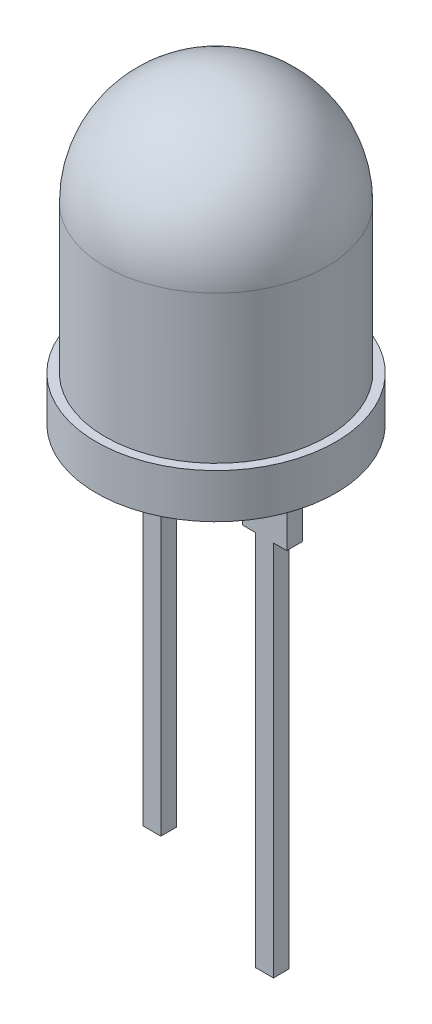
ISO-10303-21;
HEADER;
FILE_DESCRIPTION(('STEP AP214'),'2;1');
FILE_NAME('part.step','',(''),(''),'','','');
FILE_SCHEMA(('AUTOMOTIVE_DESIGN { 1 0 10303 214 1 1 1 1 }'));
ENDSEC;
DATA;
#1=APPLICATION_CONTEXT('core data for automotive mechanical design processes');
#2=APPLICATION_PROTOCOL_DEFINITION('international standard','automotive_design',2000,#1);
#3=PRODUCT_CONTEXT('',#1,'mechanical');
#4=PRODUCT('Part','Part','',(#3));
#5=PRODUCT_RELATED_PRODUCT_CATEGORY('part','',(#4));
#6=PRODUCT_DEFINITION_FORMATION('','',#4);
#7=PRODUCT_DEFINITION_CONTEXT('part definition',#1,'design');
#8=PRODUCT_DEFINITION('design','',#6,#7);
#9=PRODUCT_DEFINITION_SHAPE('','',#8);
#10=(LENGTH_UNIT() NAMED_UNIT(*) SI_UNIT(.MILLI.,.METRE.));
#11=(NAMED_UNIT(*) PLANE_ANGLE_UNIT() SI_UNIT($,.RADIAN.));
#12=(NAMED_UNIT(*) SI_UNIT($,.STERADIAN.) SOLID_ANGLE_UNIT());
#13=UNCERTAINTY_MEASURE_WITH_UNIT(LENGTH_MEASURE(1.E-05),#10,'distance_accuracy_value','');
#14=(GEOMETRIC_REPRESENTATION_CONTEXT(3) GLOBAL_UNCERTAINTY_ASSIGNED_CONTEXT((#13)) GLOBAL_UNIT_ASSIGNED_CONTEXT((#10,
#11,#12)) REPRESENTATION_CONTEXT('',''));
#15=CARTESIAN_POINT('',(0.,0.,0.));
#16=DIRECTION('',(0.,0.,1.));
#17=DIRECTION('',(1.,0.,0.));
#18=AXIS2_PLACEMENT_3D('',#15,#16,#17);
#19=CARTESIAN_POINT('',(0.,0.,0.));
#20=DIRECTION('',(0.,-1.,0.));
#21=DIRECTION('',(0.,0.,-1.));
#22=AXIS2_PLACEMENT_3D('',#19,#20,#21);
#23=PLANE('',#22);
#24=DIRECTION('',(0.,0.,-1.));
#25=VECTOR('',#24,1.);
#26=CARTESIAN_POINT('',(1.54,0.,0.35));
#27=LINE('',#26,#25);
#28=CARTESIAN_POINT('',(1.54,0.,0.35));
#29=VERTEX_POINT('',#28);
#30=CARTESIAN_POINT('',(1.54,0.,-0.35));
#31=VERTEX_POINT('',#30);
#32=EDGE_CURVE('E227',#29,#31,#27,.T.);
#33=ORIENTED_EDGE('',*,*,#32,.F.);
#34=DIRECTION('',(-1.,0.,0.));
#35=VECTOR('',#34,1.);
#36=CARTESIAN_POINT('',(3.54,0.,0.35));
#37=LINE('',#36,#35);
#38=CARTESIAN_POINT('',(3.54,0.,0.35));
#39=VERTEX_POINT('',#38);
#40=EDGE_CURVE('E175',#39,#29,#37,.T.);
#41=ORIENTED_EDGE('',*,*,#40,.F.);
#42=DIRECTION('',(0.,0.,-1.));
#43=VECTOR('',#42,1.);
#44=CARTESIAN_POINT('',(3.54,0.,0.35));
#45=LINE('',#44,#43);
#46=CARTESIAN_POINT('',(3.54,0.,-0.35));
#47=VERTEX_POINT('',#46);
#48=EDGE_CURVE('E193',#39,#47,#45,.T.);
#49=ORIENTED_EDGE('',*,*,#48,.T.);
#50=DIRECTION('',(-1.,0.,0.));
#51=VECTOR('',#50,1.);
#52=CARTESIAN_POINT('',(3.54,0.,-0.35));
#53=LINE('',#52,#51);
#54=EDGE_CURVE('E167',#47,#31,#53,.T.);
#55=ORIENTED_EDGE('',*,*,#54,.T.);
#56=EDGE_LOOP('',(#33,#41,#49,#55));
#57=FACE_BOUND('',#56,.T.);
#58=CARTESIAN_POINT('',(0.,0.,0.));
#59=DIRECTION('',(0.,-1.,0.));
#60=DIRECTION('',(0.,0.,-1.));
#61=AXIS2_PLACEMENT_3D('',#58,#59,#60);
#62=CIRCLE('',#61,5.4);
#63=CARTESIAN_POINT('',(0.,0.,-5.4));
#64=VERTEX_POINT('',#63);
#65=EDGE_CURVE('E11',#64,#64,#62,.T.);
#66=ORIENTED_EDGE('',*,*,#65,.T.);
#67=EDGE_LOOP('',(#66));
#68=FACE_BOUND('',#67,.T.);
#69=DIRECTION('',(0.,0.,-1.));
#70=VECTOR('',#69,1.);
#71=CARTESIAN_POINT('',(-3.54,0.,0.35));
#72=LINE('',#71,#70);
#73=CARTESIAN_POINT('',(-3.54,0.,0.35));
#74=VERTEX_POINT('',#73);
#75=CARTESIAN_POINT('',(-3.54,0.,-0.35));
#76=VERTEX_POINT('',#75);
#77=EDGE_CURVE('E51',#74,#76,#72,.T.);
#78=ORIENTED_EDGE('',*,*,#77,.F.);
#79=DIRECTION('',(-1.,0.,0.));
#80=VECTOR('',#79,1.);
#81=CARTESIAN_POINT('',(-3.54,0.,0.35));
#82=LINE('',#81,#80);
#83=CARTESIAN_POINT('',(-1.54,0.,0.35));
#84=VERTEX_POINT('',#83);
#85=EDGE_CURVE('E46',#84,#74,#82,.T.);
#86=ORIENTED_EDGE('',*,*,#85,.F.);
#87=DIRECTION('',(0.,0.,-1.));
#88=VECTOR('',#87,1.);
#89=CARTESIAN_POINT('',(-1.54,0.,0.35));
#90=LINE('',#89,#88);
#91=CARTESIAN_POINT('',(-1.54,0.,-0.35));
#92=VERTEX_POINT('',#91);
#93=EDGE_CURVE('E171',#84,#92,#90,.T.);
#94=ORIENTED_EDGE('',*,*,#93,.T.);
#95=DIRECTION('',(-1.,0.,0.));
#96=VECTOR('',#95,1.);
#97=CARTESIAN_POINT('',(-3.54,0.,-0.35));
#98=LINE('',#97,#96);
#99=EDGE_CURVE('E471',#92,#76,#98,.T.);
#100=ORIENTED_EDGE('',*,*,#99,.T.);
#101=EDGE_LOOP('',(#78,#86,#94,#100));
#102=FACE_BOUND('',#101,.T.);
#103=ADVANCED_FACE('F32',(#57,#68,#102),#23,.T.);
#104=CARTESIAN_POINT('',(0.,0.,0.));
#105=DIRECTION('',(0.,-1.,0.));
#106=DIRECTION('',(0.,0.,-1.));
#107=AXIS2_PLACEMENT_3D('',#104,#105,#106);
#108=CYLINDRICAL_SURFACE('',#107,5.4);
#109=CARTESIAN_POINT('',(0.,2.,0.));
#110=DIRECTION('',(0.,-1.,0.));
#111=DIRECTION('',(0.,0.,-1.));
#112=AXIS2_PLACEMENT_3D('',#109,#110,#111);
#113=CIRCLE('',#112,5.4);
#114=CARTESIAN_POINT('',(0.,2.,-5.4));
#115=VERTEX_POINT('',#114);
#116=EDGE_CURVE('E39',#115,#115,#113,.T.);
#117=ORIENTED_EDGE('',*,*,#116,.T.);
#118=EDGE_LOOP('',(#117));
#119=FACE_BOUND('',#118,.T.);
#120=ORIENTED_EDGE('',*,*,#65,.F.);
#121=EDGE_LOOP('',(#120));
#122=FACE_BOUND('',#121,.T.);
#123=ADVANCED_FACE('F238',(#119,#122),#108,.T.);
#124=CARTESIAN_POINT('',(5.4,2.,0.));
#125=DIRECTION('',(0.,1.,0.));
#126=DIRECTION('',(0.,0.,1.));
#127=AXIS2_PLACEMENT_3D('',#124,#125,#126);
#128=PLANE('',#127);
#129=CARTESIAN_POINT('',(0.,2.,0.));
#130=DIRECTION('',(0.,-1.,0.));
#131=DIRECTION('',(0.,0.,-1.));
#132=AXIS2_PLACEMENT_3D('',#129,#130,#131);
#133=CIRCLE('',#132,5.);
#134=CARTESIAN_POINT('',(0.,2.,-5.));
#135=VERTEX_POINT('',#134);
#136=EDGE_CURVE('E233',#135,#135,#133,.T.);
#137=ORIENTED_EDGE('',*,*,#136,.T.);
#138=EDGE_LOOP('',(#137));
#139=FACE_BOUND('',#138,.T.);
#140=ORIENTED_EDGE('',*,*,#116,.F.);
#141=EDGE_LOOP('',(#140));
#142=FACE_BOUND('',#141,.T.);
#143=ADVANCED_FACE('F241',(#139,#142),#128,.T.);
#144=CARTESIAN_POINT('',(0.,0.,0.));
#145=DIRECTION('',(0.,-1.,0.));
#146=DIRECTION('',(0.,0.,-1.));
#147=AXIS2_PLACEMENT_3D('',#144,#145,#146);
#148=CYLINDRICAL_SURFACE('',#147,5.);
#149=CARTESIAN_POINT('',(0.,8.65,0.));
#150=DIRECTION('',(0.,-1.,0.));
#151=DIRECTION('',(0.,0.,-1.));
#152=AXIS2_PLACEMENT_3D('',#149,#150,#151);
#153=CIRCLE('',#152,5.);
#154=CARTESIAN_POINT('',(0.,8.65,-5.));
#155=VERTEX_POINT('',#154);
#156=EDGE_CURVE('E230',#155,#155,#153,.T.);
#157=ORIENTED_EDGE('',*,*,#156,.T.);
#158=EDGE_LOOP('',(#157));
#159=FACE_BOUND('',#158,.T.);
#160=ORIENTED_EDGE('',*,*,#136,.F.);
#161=EDGE_LOOP('',(#160));
#162=FACE_BOUND('',#161,.T.);
#163=ADVANCED_FACE('F243',(#159,#162),#148,.T.);
#164=CARTESIAN_POINT('',(0.,8.65,0.));
#165=DIRECTION('',(0.,-1.,0.));
#166=DIRECTION('',(1.,0.,0.));
#167=AXIS2_PLACEMENT_3D('',#164,#165,#166);
#168=SPHERICAL_SURFACE('',#167,5.);
#169=ORIENTED_EDGE('',*,*,#156,.F.);
#170=EDGE_LOOP('',(#169));
#171=FACE_BOUND('',#170,.T.);
#172=ADVANCED_FACE('F250',(#171),#168,.T.);
#173=CARTESIAN_POINT('',(1.54,-3.,0.35));
#174=DIRECTION('',(1.,0.,0.));
#175=DIRECTION('',(0.,1.,0.));
#176=AXIS2_PLACEMENT_3D('',#173,#174,#175);
#177=PLANE('',#176);
#178=DIRECTION('',(0.,-1.,0.));
#179=VECTOR('',#178,1.);
#180=CARTESIAN_POINT('',(1.54,-3.,-0.35));
#181=LINE('',#180,#179);
#182=CARTESIAN_POINT('',(1.54,-3.,-0.35));
#183=VERTEX_POINT('',#182);
#184=EDGE_CURVE('E169',#31,#183,#181,.T.);
#185=ORIENTED_EDGE('',*,*,#184,.T.);
#186=DIRECTION('',(0.,0.,-1.));
#187=VECTOR('',#186,1.);
#188=CARTESIAN_POINT('',(1.54,-3.,0.35));
#189=LINE('',#188,#187);
#190=CARTESIAN_POINT('',(1.54,-3.,0.35));
#191=VERTEX_POINT('',#190);
#192=EDGE_CURVE('E224',#191,#183,#189,.T.);
#193=ORIENTED_EDGE('',*,*,#192,.F.);
#194=DIRECTION('',(0.,-1.,0.));
#195=VECTOR('',#194,1.);
#196=CARTESIAN_POINT('',(1.54,-3.,0.35));
#197=LINE('',#196,#195);
#198=EDGE_CURVE('E178',#29,#191,#197,.T.);
#199=ORIENTED_EDGE('',*,*,#198,.F.);
#200=ORIENTED_EDGE('',*,*,#32,.T.);
#201=EDGE_LOOP('',(#185,#193,#199,#200));
#202=FACE_BOUND('',#201,.T.);
#203=ADVANCED_FACE('F264',(#202),#177,.F.);
#204=CARTESIAN_POINT('',(2.14,-3.,0.35));
#205=DIRECTION('',(0.,1.,0.));
#206=DIRECTION('',(-1.,0.,0.));
#207=AXIS2_PLACEMENT_3D('',#204,#205,#206);
#208=PLANE('',#207);
#209=DIRECTION('',(1.,0.,0.));
#210=VECTOR('',#209,1.);
#211=CARTESIAN_POINT('',(2.14,-3.,-0.35));
#212=LINE('',#211,#210);
#213=CARTESIAN_POINT('',(2.14,-3.,-0.35));
#214=VERTEX_POINT('',#213);
#215=EDGE_CURVE('E196',#183,#214,#212,.T.);
#216=ORIENTED_EDGE('',*,*,#215,.T.);
#217=DIRECTION('',(0.,0.,-1.));
#218=VECTOR('',#217,1.);
#219=CARTESIAN_POINT('',(2.14,-3.,0.35));
#220=LINE('',#219,#218);
#221=CARTESIAN_POINT('',(2.14,-3.,0.35));
#222=VERTEX_POINT('',#221);
#223=EDGE_CURVE('E221',#222,#214,#220,.T.);
#224=ORIENTED_EDGE('',*,*,#223,.F.);
#225=DIRECTION('',(1.,0.,0.));
#226=VECTOR('',#225,1.);
#227=CARTESIAN_POINT('',(2.14,-3.,0.35));
#228=LINE('',#227,#226);
#229=EDGE_CURVE('E181',#191,#222,#228,.T.);
#230=ORIENTED_EDGE('',*,*,#229,.F.);
#231=ORIENTED_EDGE('',*,*,#192,.T.);
#232=EDGE_LOOP('',(#216,#224,#230,#231));
#233=FACE_BOUND('',#232,.T.);
#234=ADVANCED_FACE('F281',(#233),#208,.F.);
#235=CARTESIAN_POINT('',(2.14,-3.,0.35));
#236=DIRECTION('',(1.,0.,0.));
#237=DIRECTION('',(0.,1.,0.));
#238=AXIS2_PLACEMENT_3D('',#235,#236,#237);
#239=PLANE('',#238);
#240=DIRECTION('',(0.,-1.,0.));
#241=VECTOR('',#240,1.);
#242=CARTESIAN_POINT('',(2.14,-3.,-0.35));
#243=LINE('',#242,#241);
#244=CARTESIAN_POINT('',(2.14,-20.,-0.35));
#245=VERTEX_POINT('',#244);
#246=EDGE_CURVE('E198',#214,#245,#243,.T.);
#247=ORIENTED_EDGE('',*,*,#246,.T.);
#248=DIRECTION('',(0.,0.,-1.));
#249=VECTOR('',#248,1.);
#250=CARTESIAN_POINT('',(2.14,-20.,0.35));
#251=LINE('',#250,#249);
#252=CARTESIAN_POINT('',(2.14,-20.,0.35));
#253=VERTEX_POINT('',#252);
#254=EDGE_CURVE('E218',#253,#245,#251,.T.);
#255=ORIENTED_EDGE('',*,*,#254,.F.);
#256=DIRECTION('',(0.,-1.,0.));
#257=VECTOR('',#256,1.);
#258=CARTESIAN_POINT('',(2.14,-3.,0.35));
#259=LINE('',#258,#257);
#260=EDGE_CURVE('E183',#222,#253,#259,.T.);
#261=ORIENTED_EDGE('',*,*,#260,.F.);
#262=ORIENTED_EDGE('',*,*,#223,.T.);
#263=EDGE_LOOP('',(#247,#255,#261,#262));
#264=FACE_BOUND('',#263,.T.);
#265=ADVANCED_FACE('F288',(#264),#239,.F.);
#266=CARTESIAN_POINT('',(2.14,-20.,0.35));
#267=DIRECTION('',(0.,1.,0.));
#268=DIRECTION('',(0.,0.,1.));
#269=AXIS2_PLACEMENT_3D('',#266,#267,#268);
#270=PLANE('',#269);
#271=DIRECTION('',(1.,0.,0.));
#272=VECTOR('',#271,1.);
#273=CARTESIAN_POINT('',(2.14,-20.,-0.35));
#274=LINE('',#273,#272);
#275=CARTESIAN_POINT('',(2.94,-20.,-0.35));
#276=VERTEX_POINT('',#275);
#277=EDGE_CURVE('E200',#245,#276,#274,.T.);
#278=ORIENTED_EDGE('',*,*,#277,.T.);
#279=DIRECTION('',(0.,0.,-1.));
#280=VECTOR('',#279,1.);
#281=CARTESIAN_POINT('',(2.94,-20.,0.35));
#282=LINE('',#281,#280);
#283=CARTESIAN_POINT('',(2.94,-20.,0.35));
#284=VERTEX_POINT('',#283);
#285=EDGE_CURVE('E215',#284,#276,#282,.T.);
#286=ORIENTED_EDGE('',*,*,#285,.F.);
#287=DIRECTION('',(1.,0.,0.));
#288=VECTOR('',#287,1.);
#289=CARTESIAN_POINT('',(2.14,-20.,0.35));
#290=LINE('',#289,#288);
#291=EDGE_CURVE('E185',#253,#284,#290,.T.);
#292=ORIENTED_EDGE('',*,*,#291,.F.);
#293=ORIENTED_EDGE('',*,*,#254,.T.);
#294=EDGE_LOOP('',(#278,#286,#292,#293));
#295=FACE_BOUND('',#294,.T.);
#296=ADVANCED_FACE('F291',(#295),#270,.F.);
#297=CARTESIAN_POINT('',(2.94,-3.,0.35));
#298=DIRECTION('',(-1.,0.,0.));
#299=DIRECTION('',(0.,-1.,0.));
#300=AXIS2_PLACEMENT_3D('',#297,#298,#299);
#301=PLANE('',#300);
#302=DIRECTION('',(0.,1.,0.));
#303=VECTOR('',#302,1.);
#304=CARTESIAN_POINT('',(2.94,-3.,-0.35));
#305=LINE('',#304,#303);
#306=CARTESIAN_POINT('',(2.94,-3.,-0.35));
#307=VERTEX_POINT('',#306);
#308=EDGE_CURVE('E202',#276,#307,#305,.T.);
#309=ORIENTED_EDGE('',*,*,#308,.T.);
#310=DIRECTION('',(0.,0.,-1.));
#311=VECTOR('',#310,1.);
#312=CARTESIAN_POINT('',(2.94,-3.,0.35));
#313=LINE('',#312,#311);
#314=CARTESIAN_POINT('',(2.94,-3.,0.35));
#315=VERTEX_POINT('',#314);
#316=EDGE_CURVE('E212',#315,#307,#313,.T.);
#317=ORIENTED_EDGE('',*,*,#316,.F.);
#318=DIRECTION('',(0.,1.,0.));
#319=VECTOR('',#318,1.);
#320=CARTESIAN_POINT('',(2.94,-3.,0.35));
#321=LINE('',#320,#319);
#322=EDGE_CURVE('E187',#284,#315,#321,.T.);
#323=ORIENTED_EDGE('',*,*,#322,.F.);
#324=ORIENTED_EDGE('',*,*,#285,.T.);
#325=EDGE_LOOP('',(#309,#317,#323,#324));
#326=FACE_BOUND('',#325,.T.);
#327=ADVANCED_FACE('F296',(#326),#301,.F.);
#328=CARTESIAN_POINT('',(2.94,-3.,0.35));
#329=DIRECTION('',(0.,1.,0.));
#330=DIRECTION('',(0.,0.,1.));
#331=AXIS2_PLACEMENT_3D('',#328,#329,#330);
#332=PLANE('',#331);
#333=DIRECTION('',(1.,0.,0.));
#334=VECTOR('',#333,1.);
#335=CARTESIAN_POINT('',(2.94,-3.,-0.35));
#336=LINE('',#335,#334);
#337=CARTESIAN_POINT('',(3.54,-3.,-0.35));
#338=VERTEX_POINT('',#337);
#339=EDGE_CURVE('E204',#307,#338,#336,.T.);
#340=ORIENTED_EDGE('',*,*,#339,.T.);
#341=DIRECTION('',(0.,0.,-1.));
#342=VECTOR('',#341,1.);
#343=CARTESIAN_POINT('',(3.54,-3.,0.35));
#344=LINE('',#343,#342);
#345=CARTESIAN_POINT('',(3.54,-3.,0.35));
#346=VERTEX_POINT('',#345);
#347=EDGE_CURVE('E209',#346,#338,#344,.T.);
#348=ORIENTED_EDGE('',*,*,#347,.F.);
#349=DIRECTION('',(1.,0.,0.));
#350=VECTOR('',#349,1.);
#351=CARTESIAN_POINT('',(2.94,-3.,0.35));
#352=LINE('',#351,#350);
#353=EDGE_CURVE('E189',#315,#346,#352,.T.);
#354=ORIENTED_EDGE('',*,*,#353,.F.);
#355=ORIENTED_EDGE('',*,*,#316,.T.);
#356=EDGE_LOOP('',(#340,#348,#354,#355));
#357=FACE_BOUND('',#356,.T.);
#358=ADVANCED_FACE('F298',(#357),#332,.F.);
#359=CARTESIAN_POINT('',(3.54,-3.,0.35));
#360=DIRECTION('',(-1.,0.,0.));
#361=DIRECTION('',(0.,0.,1.));
#362=AXIS2_PLACEMENT_3D('',#359,#360,#361);
#363=PLANE('',#362);
#364=DIRECTION('',(0.,1.,0.));
#365=VECTOR('',#364,1.);
#366=CARTESIAN_POINT('',(3.54,-3.,-0.35));
#367=LINE('',#366,#365);
#368=EDGE_CURVE('E179',#338,#47,#367,.T.);
#369=ORIENTED_EDGE('',*,*,#368,.T.);
#370=ORIENTED_EDGE('',*,*,#48,.F.);
#371=DIRECTION('',(0.,1.,0.));
#372=VECTOR('',#371,1.);
#373=CARTESIAN_POINT('',(3.54,-3.,0.35));
#374=LINE('',#373,#372);
#375=EDGE_CURVE('E191',#346,#39,#374,.T.);
#376=ORIENTED_EDGE('',*,*,#375,.F.);
#377=ORIENTED_EDGE('',*,*,#347,.T.);
#378=EDGE_LOOP('',(#369,#370,#376,#377));
#379=FACE_BOUND('',#378,.T.);
#380=ADVANCED_FACE('F273',(#379),#363,.F.);
#381=CARTESIAN_POINT('',(0.,0.,0.35));
#382=DIRECTION('',(0.,0.,-1.));
#383=DIRECTION('',(-1.,0.,0.));
#384=AXIS2_PLACEMENT_3D('',#381,#382,#383);
#385=PLANE('',#384);
#386=ORIENTED_EDGE('',*,*,#40,.T.);
#387=ORIENTED_EDGE('',*,*,#198,.T.);
#388=ORIENTED_EDGE('',*,*,#229,.T.);
#389=ORIENTED_EDGE('',*,*,#260,.T.);
#390=ORIENTED_EDGE('',*,*,#291,.T.);
#391=ORIENTED_EDGE('',*,*,#322,.T.);
#392=ORIENTED_EDGE('',*,*,#353,.T.);
#393=ORIENTED_EDGE('',*,*,#375,.T.);
#394=EDGE_LOOP('',(#386,#387,#388,#389,#390,#391,#392,#393));
#395=FACE_BOUND('',#394,.T.);
#396=ADVANCED_FACE('F267',(#395),#385,.F.);
#397=CARTESIAN_POINT('',(0.,0.,-0.35));
#398=DIRECTION('',(0.,0.,-1.));
#399=DIRECTION('',(-1.,0.,0.));
#400=AXIS2_PLACEMENT_3D('',#397,#398,#399);
#401=PLANE('',#400);
#402=ORIENTED_EDGE('',*,*,#54,.F.);
#403=ORIENTED_EDGE('',*,*,#368,.F.);
#404=ORIENTED_EDGE('',*,*,#339,.F.);
#405=ORIENTED_EDGE('',*,*,#308,.F.);
#406=ORIENTED_EDGE('',*,*,#277,.F.);
#407=ORIENTED_EDGE('',*,*,#246,.F.);
#408=ORIENTED_EDGE('',*,*,#215,.F.);
#409=ORIENTED_EDGE('',*,*,#184,.F.);
#410=EDGE_LOOP('',(#402,#403,#404,#405,#406,#407,#408,#409));
#411=FACE_BOUND('',#410,.T.);
#412=ADVANCED_FACE('F277',(#411),#401,.T.);
#413=CARTESIAN_POINT('',(-2.14,-3.,0.35));
#414=DIRECTION('',(-1.,0.,0.));
#415=DIRECTION('',(0.,-1.,0.));
#416=AXIS2_PLACEMENT_3D('',#413,#414,#415);
#417=PLANE('',#416);
#418=DIRECTION('',(0.,1.,0.));
#419=VECTOR('',#418,1.);
#420=CARTESIAN_POINT('',(-2.14,-3.,-0.35));
#421=LINE('',#420,#419);
#422=CARTESIAN_POINT('',(-2.14,-17.,-0.35));
#423=VERTEX_POINT('',#422);
#424=CARTESIAN_POINT('',(-2.14,-3.,-0.35));
#425=VERTEX_POINT('',#424);
#426=EDGE_CURVE('E166',#423,#425,#421,.T.);
#427=ORIENTED_EDGE('',*,*,#426,.T.);
#428=DIRECTION('',(0.,0.,-1.));
#429=VECTOR('',#428,1.);
#430=CARTESIAN_POINT('',(-2.14,-3.,0.35));
#431=LINE('',#430,#429);
#432=CARTESIAN_POINT('',(-2.14,-3.,0.35));
#433=VERTEX_POINT('',#432);
#434=EDGE_CURVE('E146',#433,#425,#431,.T.);
#435=ORIENTED_EDGE('',*,*,#434,.F.);
#436=DIRECTION('',(0.,1.,0.));
#437=VECTOR('',#436,1.);
#438=CARTESIAN_POINT('',(-2.14,-3.,0.35));
#439=LINE('',#438,#437);
#440=CARTESIAN_POINT('',(-2.14,-17.,0.35));
#441=VERTEX_POINT('',#440);
#442=EDGE_CURVE('E153',#441,#433,#439,.T.);
#443=ORIENTED_EDGE('',*,*,#442,.F.);
#444=DIRECTION('',(0.,0.,-1.));
#445=VECTOR('',#444,1.);
#446=CARTESIAN_POINT('',(-2.14,-17.,0.35));
#447=LINE('',#446,#445);
#448=EDGE_CURVE('E480',#441,#423,#447,.T.);
#449=ORIENTED_EDGE('',*,*,#448,.T.);
#450=EDGE_LOOP('',(#427,#435,#443,#449));
#451=FACE_BOUND('',#450,.T.);
#452=ADVANCED_FACE('F164',(#451),#417,.F.);
#453=CARTESIAN_POINT('',(-2.14,-3.,0.35));
#454=DIRECTION('',(0.,1.,0.));
#455=DIRECTION('',(-1.,0.,0.));
#456=AXIS2_PLACEMENT_3D('',#453,#454,#455);
#457=PLANE('',#456);
#458=DIRECTION('',(1.,0.,0.));
#459=VECTOR('',#458,1.);
#460=CARTESIAN_POINT('',(-2.14,-3.,-0.35));
#461=LINE('',#460,#459);
#462=CARTESIAN_POINT('',(-1.54,-3.,-0.35));
#463=VERTEX_POINT('',#462);
#464=EDGE_CURVE('E462',#425,#463,#461,.T.);
#465=ORIENTED_EDGE('',*,*,#464,.T.);
#466=DIRECTION('',(0.,0.,-1.));
#467=VECTOR('',#466,1.);
#468=CARTESIAN_POINT('',(-1.54,-3.,0.35));
#469=LINE('',#468,#467);
#470=CARTESIAN_POINT('',(-1.54,-3.,0.35));
#471=VERTEX_POINT('',#470);
#472=EDGE_CURVE('E149',#471,#463,#469,.T.);
#473=ORIENTED_EDGE('',*,*,#472,.F.);
#474=DIRECTION('',(1.,0.,0.));
#475=VECTOR('',#474,1.);
#476=CARTESIAN_POINT('',(-2.14,-3.,0.35));
#477=LINE('',#476,#475);
#478=EDGE_CURVE('E142',#433,#471,#477,.T.);
#479=ORIENTED_EDGE('',*,*,#478,.F.);
#480=ORIENTED_EDGE('',*,*,#434,.T.);
#481=EDGE_LOOP('',(#465,#473,#479,#480));
#482=FACE_BOUND('',#481,.T.);
#483=ADVANCED_FACE('F144',(#482),#457,.F.);
#484=CARTESIAN_POINT('',(-1.54,-3.,0.35));
#485=DIRECTION('',(-1.,0.,0.));
#486=DIRECTION('',(0.,-1.,0.));
#487=AXIS2_PLACEMENT_3D('',#484,#485,#486);
#488=PLANE('',#487);
#489=DIRECTION('',(0.,1.,0.));
#490=VECTOR('',#489,1.);
#491=CARTESIAN_POINT('',(-1.54,-3.,-0.35));
#492=LINE('',#491,#490);
#493=EDGE_CURVE('E464',#463,#92,#492,.T.);
#494=ORIENTED_EDGE('',*,*,#493,.T.);
#495=ORIENTED_EDGE('',*,*,#93,.F.);
#496=DIRECTION('',(0.,1.,0.));
#497=VECTOR('',#496,1.);
#498=CARTESIAN_POINT('',(-1.54,-3.,0.35));
#499=LINE('',#498,#497);
#500=EDGE_CURVE('E152',#471,#84,#499,.T.);
#501=ORIENTED_EDGE('',*,*,#500,.F.);
#502=ORIENTED_EDGE('',*,*,#472,.T.);
#503=EDGE_LOOP('',(#494,#495,#501,#502));
#504=FACE_BOUND('',#503,.T.);
#505=ADVANCED_FACE('F388',(#504),#488,.F.);
#506=CARTESIAN_POINT('',(-3.54,-3.,0.35));
#507=DIRECTION('',(1.,0.,0.));
#508=DIRECTION('',(0.,0.,-1.));
#509=AXIS2_PLACEMENT_3D('',#506,#507,#508);
#510=PLANE('',#509);
#511=DIRECTION('',(0.,-1.,0.));
#512=VECTOR('',#511,1.);
#513=CARTESIAN_POINT('',(-3.54,-3.,-0.35));
#514=LINE('',#513,#512);
#515=CARTESIAN_POINT('',(-3.54,-3.,-0.35));
#516=VERTEX_POINT('',#515);
#517=EDGE_CURVE('E473',#76,#516,#514,.T.);
#518=ORIENTED_EDGE('',*,*,#517,.T.);
#519=DIRECTION('',(0.,0.,-1.));
#520=VECTOR('',#519,1.);
#521=CARTESIAN_POINT('',(-3.54,-3.,0.35));
#522=LINE('',#521,#520);
#523=CARTESIAN_POINT('',(-3.54,-3.,0.35));
#524=VERTEX_POINT('',#523);
#525=EDGE_CURVE('E488',#524,#516,#522,.T.);
#526=ORIENTED_EDGE('',*,*,#525,.F.);
#527=DIRECTION('',(0.,-1.,0.));
#528=VECTOR('',#527,1.);
#529=CARTESIAN_POINT('',(-3.54,-3.,0.35));
#530=LINE('',#529,#528);
#531=EDGE_CURVE('E502',#74,#524,#530,.T.);
#532=ORIENTED_EDGE('',*,*,#531,.F.);
#533=ORIENTED_EDGE('',*,*,#77,.T.);
#534=EDGE_LOOP('',(#518,#526,#532,#533));
#535=FACE_BOUND('',#534,.T.);
#536=ADVANCED_FACE('F397',(#535),#510,.F.);
#537=CARTESIAN_POINT('',(-2.94,-3.,0.35));
#538=DIRECTION('',(0.,1.,0.));
#539=DIRECTION('',(0.,0.,1.));
#540=AXIS2_PLACEMENT_3D('',#537,#538,#539);
#541=PLANE('',#540);
#542=DIRECTION('',(1.,0.,0.));
#543=VECTOR('',#542,1.);
#544=CARTESIAN_POINT('',(-2.94,-3.,-0.35));
#545=LINE('',#544,#543);
#546=CARTESIAN_POINT('',(-2.94,-3.,-0.35));
#547=VERTEX_POINT('',#546);
#548=EDGE_CURVE('E475',#516,#547,#545,.T.);
#549=ORIENTED_EDGE('',*,*,#548,.T.);
#550=DIRECTION('',(0.,0.,-1.));
#551=VECTOR('',#550,1.);
#552=CARTESIAN_POINT('',(-2.94,-3.,0.35));
#553=LINE('',#552,#551);
#554=CARTESIAN_POINT('',(-2.94,-3.,0.35));
#555=VERTEX_POINT('',#554);
#556=EDGE_CURVE('E485',#555,#547,#553,.T.);
#557=ORIENTED_EDGE('',*,*,#556,.F.);
#558=DIRECTION('',(1.,0.,0.));
#559=VECTOR('',#558,1.);
#560=CARTESIAN_POINT('',(-2.94,-3.,0.35));
#561=LINE('',#560,#559);
#562=EDGE_CURVE('E499',#524,#555,#561,.T.);
#563=ORIENTED_EDGE('',*,*,#562,.F.);
#564=ORIENTED_EDGE('',*,*,#525,.T.);
#565=EDGE_LOOP('',(#549,#557,#563,#564));
#566=FACE_BOUND('',#565,.T.);
#567=ADVANCED_FACE('F407',(#566),#541,.F.);
#568=CARTESIAN_POINT('',(-2.94,-3.,0.35));
#569=DIRECTION('',(1.,0.,0.));
#570=DIRECTION('',(0.,1.,0.));
#571=AXIS2_PLACEMENT_3D('',#568,#569,#570);
#572=PLANE('',#571);
#573=DIRECTION('',(0.,-1.,0.));
#574=VECTOR('',#573,1.);
#575=CARTESIAN_POINT('',(-2.94,-3.,-0.35));
#576=LINE('',#575,#574);
#577=CARTESIAN_POINT('',(-2.94,-17.,-0.35));
#578=VERTEX_POINT('',#577);
#579=EDGE_CURVE('E477',#547,#578,#576,.T.);
#580=ORIENTED_EDGE('',*,*,#579,.T.);
#581=DIRECTION('',(0.,0.,-1.));
#582=VECTOR('',#581,1.);
#583=CARTESIAN_POINT('',(-2.94,-17.,0.35));
#584=LINE('',#583,#582);
#585=CARTESIAN_POINT('',(-2.94,-17.,0.35));
#586=VERTEX_POINT('',#585);
#587=EDGE_CURVE('E482',#586,#578,#584,.T.);
#588=ORIENTED_EDGE('',*,*,#587,.F.);
#589=DIRECTION('',(0.,-1.,0.));
#590=VECTOR('',#589,1.);
#591=CARTESIAN_POINT('',(-2.94,-3.,0.35));
#592=LINE('',#591,#590);
#593=EDGE_CURVE('E501',#555,#586,#592,.T.);
#594=ORIENTED_EDGE('',*,*,#593,.F.);
#595=ORIENTED_EDGE('',*,*,#556,.T.);
#596=EDGE_LOOP('',(#580,#588,#594,#595));
#597=FACE_BOUND('',#596,.T.);
#598=ADVANCED_FACE('F417',(#597),#572,.F.);
#599=CARTESIAN_POINT('',(-2.14,-17.,0.35));
#600=DIRECTION('',(0.,1.,0.));
#601=DIRECTION('',(0.,0.,1.));
#602=AXIS2_PLACEMENT_3D('',#599,#600,#601);
#603=PLANE('',#602);
#604=DIRECTION('',(1.,0.,0.));
#605=VECTOR('',#604,1.);
#606=CARTESIAN_POINT('',(-2.14,-17.,-0.35));
#607=LINE('',#606,#605);
#608=EDGE_CURVE('E162',#578,#423,#607,.T.);
#609=ORIENTED_EDGE('',*,*,#608,.T.);
#610=ORIENTED_EDGE('',*,*,#448,.F.);
#611=DIRECTION('',(1.,0.,0.));
#612=VECTOR('',#611,1.);
#613=CARTESIAN_POINT('',(-2.14,-17.,0.35));
#614=LINE('',#613,#612);
#615=EDGE_CURVE('E158',#586,#441,#614,.T.);
#616=ORIENTED_EDGE('',*,*,#615,.F.);
#617=ORIENTED_EDGE('',*,*,#587,.T.);
#618=EDGE_LOOP('',(#609,#610,#616,#617));
#619=FACE_BOUND('',#618,.T.);
#620=ADVANCED_FACE('F427',(#619),#603,.F.);
#621=CARTESIAN_POINT('',(0.,0.,0.35));
#622=DIRECTION('',(0.,0.,-1.));
#623=DIRECTION('',(-1.,0.,0.));
#624=AXIS2_PLACEMENT_3D('',#621,#622,#623);
#625=PLANE('',#624);
#626=ORIENTED_EDGE('',*,*,#442,.T.);
#627=ORIENTED_EDGE('',*,*,#478,.T.);
#628=ORIENTED_EDGE('',*,*,#500,.T.);
#629=ORIENTED_EDGE('',*,*,#85,.T.);
#630=ORIENTED_EDGE('',*,*,#531,.T.);
#631=ORIENTED_EDGE('',*,*,#562,.T.);
#632=ORIENTED_EDGE('',*,*,#593,.T.);
#633=ORIENTED_EDGE('',*,*,#615,.T.);
#634=EDGE_LOOP('',(#626,#627,#628,#629,#630,#631,#632,#633));
#635=FACE_BOUND('',#634,.T.);
#636=ADVANCED_FACE('F156',(#635),#625,.F.);
#637=CARTESIAN_POINT('',(0.,0.,-0.35));
#638=DIRECTION('',(0.,0.,-1.));
#639=DIRECTION('',(-1.,0.,0.));
#640=AXIS2_PLACEMENT_3D('',#637,#638,#639);
#641=PLANE('',#640);
#642=ORIENTED_EDGE('',*,*,#426,.F.);
#643=ORIENTED_EDGE('',*,*,#608,.F.);
#644=ORIENTED_EDGE('',*,*,#579,.F.);
#645=ORIENTED_EDGE('',*,*,#548,.F.);
#646=ORIENTED_EDGE('',*,*,#517,.F.);
#647=ORIENTED_EDGE('',*,*,#99,.F.);
#648=ORIENTED_EDGE('',*,*,#493,.F.);
#649=ORIENTED_EDGE('',*,*,#464,.F.);
#650=EDGE_LOOP('',(#642,#643,#644,#645,#646,#647,#648,#649));
#651=FACE_BOUND('',#650,.T.);
#652=ADVANCED_FACE('F446',(#651),#641,.T.);
#653=CLOSED_SHELL('',(#103,#123,#143,#163,#172,#203,#234,#265,#296,#327,#358,#380,#396,#412,
#452,#483,#505,#536,#567,#598,#620,#636,#652));
#654=MANIFOLD_SOLID_BREP('B2',#653);
#655=ADVANCED_BREP_SHAPE_REPRESENTATION('',(#18,#654),#14);
#656=SHAPE_DEFINITION_REPRESENTATION(#9,#655);
ENDSEC;
END-ISO-10303-21;
